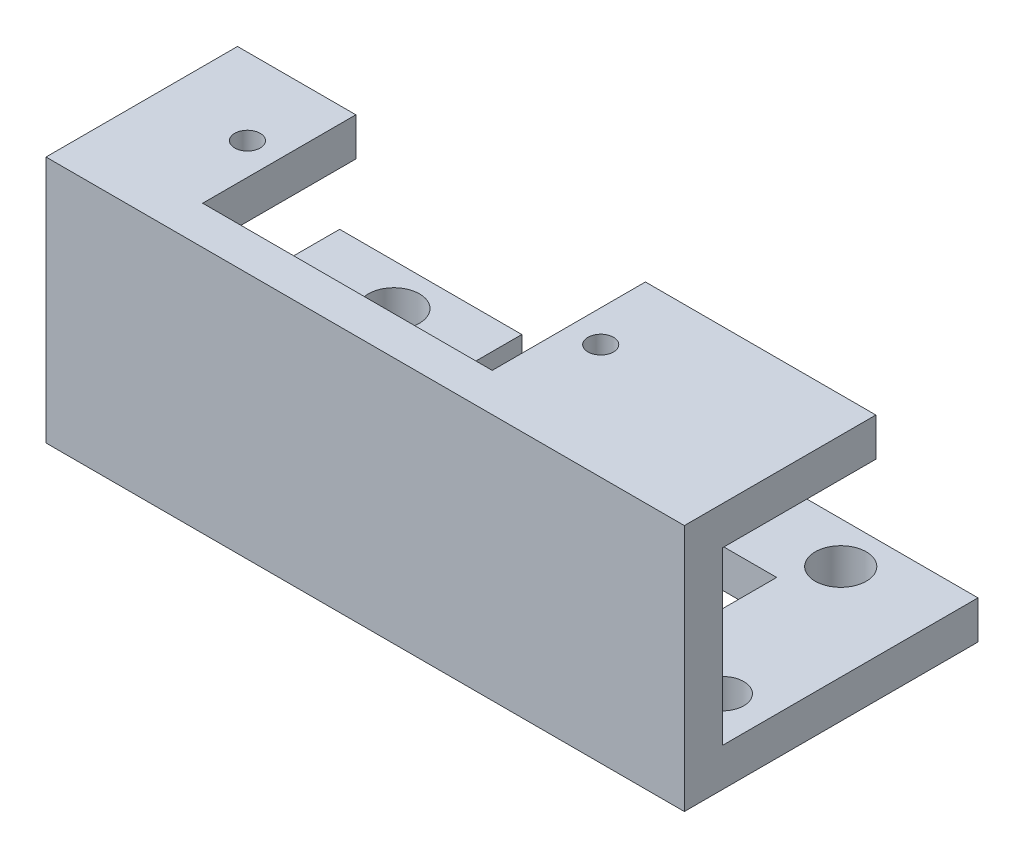
ISO-10303-21;
HEADER;
FILE_DESCRIPTION(('STEP AP214'),'2;1');
FILE_NAME('part.step','',(''),(''),'','','');
FILE_SCHEMA(('AUTOMOTIVE_DESIGN { 1 0 10303 214 1 1 1 1 }'));
ENDSEC;
DATA;
#1=APPLICATION_CONTEXT('core data for automotive mechanical design processes');
#2=APPLICATION_PROTOCOL_DEFINITION('international standard','automotive_design',2000,#1);
#3=PRODUCT_CONTEXT('',#1,'mechanical');
#4=PRODUCT('Part','Part','',(#3));
#5=PRODUCT_RELATED_PRODUCT_CATEGORY('part','',(#4));
#6=PRODUCT_DEFINITION_FORMATION('','',#4);
#7=PRODUCT_DEFINITION_CONTEXT('part definition',#1,'design');
#8=PRODUCT_DEFINITION('design','',#6,#7);
#9=PRODUCT_DEFINITION_SHAPE('','',#8);
#10=(LENGTH_UNIT() NAMED_UNIT(*) SI_UNIT(.MILLI.,.METRE.));
#11=(NAMED_UNIT(*) PLANE_ANGLE_UNIT() SI_UNIT($,.RADIAN.));
#12=(NAMED_UNIT(*) SI_UNIT($,.STERADIAN.) SOLID_ANGLE_UNIT());
#13=UNCERTAINTY_MEASURE_WITH_UNIT(LENGTH_MEASURE(1.E-05),#10,'distance_accuracy_value','');
#14=(GEOMETRIC_REPRESENTATION_CONTEXT(3) GLOBAL_UNCERTAINTY_ASSIGNED_CONTEXT((#13)) GLOBAL_UNIT_ASSIGNED_CONTEXT((#10,
#11,#12)) REPRESENTATION_CONTEXT('',''));
#15=CARTESIAN_POINT('',(0.,0.,0.));
#16=DIRECTION('',(0.,0.,1.));
#17=DIRECTION('',(1.,0.,0.));
#18=AXIS2_PLACEMENT_3D('',#15,#16,#17);
#19=CARTESIAN_POINT('',(40.73,0.,-20.));
#20=DIRECTION('',(1.,0.,0.));
#21=DIRECTION('',(0.,0.,-1.));
#22=AXIS2_PLACEMENT_3D('',#19,#20,#21);
#23=PLANE('',#22);
#24=DIRECTION('',(0.,1.,0.));
#25=VECTOR('',#24,1.);
#26=CARTESIAN_POINT('',(40.73,2.99667999749431,-13.5));
#27=LINE('',#26,#25);
#28=CARTESIAN_POINT('',(40.73,0.,-13.5));
#29=VERTEX_POINT('',#28);
#30=CARTESIAN_POINT('',(40.73,2.99667999749431,-13.5));
#31=VERTEX_POINT('',#30);
#32=EDGE_CURVE('E201',#29,#31,#27,.T.);
#33=ORIENTED_EDGE('',*,*,#32,.F.);
#34=DIRECTION('',(0.,0.,1.));
#35=VECTOR('',#34,1.);
#36=CARTESIAN_POINT('',(40.73,0.,-20.));
#37=LINE('',#36,#35);
#38=CARTESIAN_POINT('',(40.73,0.,0.));
#39=VERTEX_POINT('',#38);
#40=EDGE_CURVE('E261',#29,#39,#37,.T.);
#41=ORIENTED_EDGE('',*,*,#40,.T.);
#42=DIRECTION('',(0.,1.,0.));
#43=VECTOR('',#42,1.);
#44=CARTESIAN_POINT('',(40.73,0.,0.));
#45=LINE('',#44,#43);
#46=CARTESIAN_POINT('',(40.73,2.99667999749431,0.));
#47=VERTEX_POINT('',#46);
#48=EDGE_CURVE('E244',#39,#47,#45,.T.);
#49=ORIENTED_EDGE('',*,*,#48,.T.);
#50=DIRECTION('',(0.,0.,1.));
#51=VECTOR('',#50,1.);
#52=CARTESIAN_POINT('',(40.73,2.99667999749431,-20.));
#53=LINE('',#52,#51);
#54=EDGE_CURVE('E259',#31,#47,#53,.T.);
#55=ORIENTED_EDGE('',*,*,#54,.F.);
#56=EDGE_LOOP('',(#33,#41,#49,#55));
#57=FACE_BOUND('',#56,.T.);
#58=ADVANCED_FACE('F38',(#57),#23,.F.);
#59=CARTESIAN_POINT('',(9.27,0.,-20.));
#60=DIRECTION('',(1.,0.,0.));
#61=DIRECTION('',(0.,0.,-1.));
#62=AXIS2_PLACEMENT_3D('',#59,#60,#61);
#63=PLANE('',#62);
#64=DIRECTION('',(0.,0.,1.));
#65=VECTOR('',#64,1.);
#66=CARTESIAN_POINT('',(9.27,0.,-20.));
#67=LINE('',#66,#65);
#68=CARTESIAN_POINT('',(9.27,0.,-13.5));
#69=VERTEX_POINT('',#68);
#70=CARTESIAN_POINT('',(9.27,0.,0.));
#71=VERTEX_POINT('',#70);
#72=EDGE_CURVE('E60',#69,#71,#67,.T.);
#73=ORIENTED_EDGE('',*,*,#72,.F.);
#74=DIRECTION('',(0.,-1.,0.));
#75=VECTOR('',#74,1.);
#76=CARTESIAN_POINT('',(9.27,2.99667999749431,-13.5));
#77=LINE('',#76,#75);
#78=CARTESIAN_POINT('',(9.27,2.99667999749431,-13.5));
#79=VERTEX_POINT('',#78);
#80=EDGE_CURVE('E55',#79,#69,#77,.T.);
#81=ORIENTED_EDGE('',*,*,#80,.F.);
#82=DIRECTION('',(0.,0.,1.));
#83=VECTOR('',#82,1.);
#84=CARTESIAN_POINT('',(9.27,2.99667999749431,-20.));
#85=LINE('',#84,#83);
#86=CARTESIAN_POINT('',(9.27,2.99667999749431,0.));
#87=VERTEX_POINT('',#86);
#88=EDGE_CURVE('E233',#79,#87,#85,.T.);
#89=ORIENTED_EDGE('',*,*,#88,.T.);
#90=DIRECTION('',(0.,1.,0.));
#91=VECTOR('',#90,1.);
#92=CARTESIAN_POINT('',(9.27,0.,0.));
#93=LINE('',#92,#91);
#94=EDGE_CURVE('E237',#71,#87,#93,.T.);
#95=ORIENTED_EDGE('',*,*,#94,.F.);
#96=EDGE_LOOP('',(#73,#81,#89,#95));
#97=FACE_BOUND('',#96,.T.);
#98=ADVANCED_FACE('F364',(#97),#63,.T.);
#99=CARTESIAN_POINT('',(0.,0.,0.));
#100=DIRECTION('',(0.,0.,-1.));
#101=DIRECTION('',(-1.,0.,0.));
#102=AXIS2_PLACEMENT_3D('',#99,#100,#101);
#103=PLANE('',#102);
#104=ORIENTED_EDGE('',*,*,#94,.T.);
#105=DIRECTION('',(1.,0.,0.));
#106=VECTOR('',#105,1.);
#107=CARTESIAN_POINT('',(0.,2.99667999749431,0.));
#108=LINE('',#107,#106);
#109=CARTESIAN_POINT('',(0.,2.99667999749431,0.));
#110=VERTEX_POINT('',#109);
#111=EDGE_CURVE('E240',#110,#87,#108,.T.);
#112=ORIENTED_EDGE('',*,*,#111,.F.);
#113=DIRECTION('',(0.,-1.,0.));
#114=VECTOR('',#113,1.);
#115=CARTESIAN_POINT('',(0.,0.,0.));
#116=LINE('',#115,#114);
#117=CARTESIAN_POINT('',(0.,16.4,0.));
#118=VERTEX_POINT('',#117);
#119=EDGE_CURVE('E315',#118,#110,#116,.T.);
#120=ORIENTED_EDGE('',*,*,#119,.F.);
#121=DIRECTION('',(1.,0.,0.));
#122=VECTOR('',#121,1.);
#123=CARTESIAN_POINT('',(0.,16.4,0.));
#124=LINE('',#123,#122);
#125=CARTESIAN_POINT('',(9.27,16.4,0.));
#126=VERTEX_POINT('',#125);
#127=EDGE_CURVE('E280',#118,#126,#124,.T.);
#128=ORIENTED_EDGE('',*,*,#127,.T.);
#129=DIRECTION('',(0.,-1.,0.));
#130=VECTOR('',#129,1.);
#131=CARTESIAN_POINT('',(9.27,19.4,0.));
#132=LINE('',#131,#130);
#133=CARTESIAN_POINT('',(9.27,19.4,0.));
#134=VERTEX_POINT('',#133);
#135=EDGE_CURVE('E277',#134,#126,#132,.T.);
#136=ORIENTED_EDGE('',*,*,#135,.F.);
#137=DIRECTION('',(-1.,0.,0.));
#138=VECTOR('',#137,1.);
#139=CARTESIAN_POINT('',(0.,19.4,0.));
#140=LINE('',#139,#138);
#141=CARTESIAN_POINT('',(31.95,19.4,0.));
#142=VERTEX_POINT('',#141);
#143=EDGE_CURVE('E320',#142,#134,#140,.T.);
#144=ORIENTED_EDGE('',*,*,#143,.F.);
#145=DIRECTION('',(0.,-1.,0.));
#146=VECTOR('',#145,1.);
#147=CARTESIAN_POINT('',(31.95,19.4,0.));
#148=LINE('',#147,#146);
#149=CARTESIAN_POINT('',(31.95,16.4,0.));
#150=VERTEX_POINT('',#149);
#151=EDGE_CURVE('E296',#142,#150,#148,.T.);
#152=ORIENTED_EDGE('',*,*,#151,.T.);
#153=DIRECTION('',(-1.,0.,0.));
#154=VECTOR('',#153,1.);
#155=CARTESIAN_POINT('',(50.,16.4,0.));
#156=LINE('',#155,#154);
#157=CARTESIAN_POINT('',(50.,16.4,0.));
#158=VERTEX_POINT('',#157);
#159=EDGE_CURVE('E284',#158,#150,#156,.T.);
#160=ORIENTED_EDGE('',*,*,#159,.F.);
#161=DIRECTION('',(0.,1.,0.));
#162=VECTOR('',#161,1.);
#163=CARTESIAN_POINT('',(50.,0.,0.));
#164=LINE('',#163,#162);
#165=CARTESIAN_POINT('',(50.,2.99667999749431,0.));
#166=VERTEX_POINT('',#165);
#167=EDGE_CURVE('E332',#166,#158,#164,.T.);
#168=ORIENTED_EDGE('',*,*,#167,.F.);
#169=DIRECTION('',(-1.,0.,0.));
#170=VECTOR('',#169,1.);
#171=CARTESIAN_POINT('',(0.,2.99667999749431,0.));
#172=LINE('',#171,#170);
#173=EDGE_CURVE('E186',#166,#47,#172,.T.);
#174=ORIENTED_EDGE('',*,*,#173,.T.);
#175=ORIENTED_EDGE('',*,*,#48,.F.);
#176=DIRECTION('',(1.,0.,0.));
#177=VECTOR('',#176,1.);
#178=CARTESIAN_POINT('',(0.,0.,0.));
#179=LINE('',#178,#177);
#180=EDGE_CURVE('E329',#71,#39,#179,.T.);
#181=ORIENTED_EDGE('',*,*,#180,.F.);
#182=EDGE_LOOP('',(#104,#112,#120,#128,#136,#144,#152,#160,#168,#174,#175,#181));
#183=FACE_BOUND('',#182,.T.);
#184=ADVANCED_FACE('F369',(#183),#103,.T.);
#185=CARTESIAN_POINT('',(0.,0.,3.));
#186=DIRECTION('',(1.,0.,0.));
#187=DIRECTION('',(0.,0.,-1.));
#188=AXIS2_PLACEMENT_3D('',#185,#186,#187);
#189=PLANE('',#188);
#190=DIRECTION('',(0.,0.,-1.));
#191=VECTOR('',#190,1.);
#192=CARTESIAN_POINT('',(0.,19.4,3.));
#193=LINE('',#192,#191);
#194=CARTESIAN_POINT('',(0.,19.4,3.));
#195=VERTEX_POINT('',#194);
#196=CARTESIAN_POINT('',(0.,19.4,-12.));
#197=VERTEX_POINT('',#196);
#198=EDGE_CURVE('E326',#195,#197,#193,.T.);
#199=ORIENTED_EDGE('',*,*,#198,.T.);
#200=DIRECTION('',(0.,-1.,0.));
#201=VECTOR('',#200,1.);
#202=CARTESIAN_POINT('',(0.,19.4,-12.));
#203=LINE('',#202,#201);
#204=CARTESIAN_POINT('',(0.,16.4,-12.));
#205=VERTEX_POINT('',#204);
#206=EDGE_CURVE('E272',#197,#205,#203,.T.);
#207=ORIENTED_EDGE('',*,*,#206,.T.);
#208=DIRECTION('',(0.,0.,1.));
#209=VECTOR('',#208,1.);
#210=CARTESIAN_POINT('',(0.,16.4,-12.));
#211=LINE('',#210,#209);
#212=EDGE_CURVE('E275',#205,#118,#211,.T.);
#213=ORIENTED_EDGE('',*,*,#212,.T.);
#214=ORIENTED_EDGE('',*,*,#119,.T.);
#215=DIRECTION('',(0.,0.,1.));
#216=VECTOR('',#215,1.);
#217=CARTESIAN_POINT('',(0.,2.99667999749431,-20.));
#218=LINE('',#217,#216);
#219=CARTESIAN_POINT('',(0.,2.99667999749431,-20.));
#220=VERTEX_POINT('',#219);
#221=EDGE_CURVE('E231',#220,#110,#218,.T.);
#222=ORIENTED_EDGE('',*,*,#221,.F.);
#223=DIRECTION('',(0.,1.,0.));
#224=VECTOR('',#223,1.);
#225=CARTESIAN_POINT('',(0.,0.,-20.));
#226=LINE('',#225,#224);
#227=CARTESIAN_POINT('',(0.,0.,-20.));
#228=VERTEX_POINT('',#227);
#229=EDGE_CURVE('E241',#228,#220,#226,.T.);
#230=ORIENTED_EDGE('',*,*,#229,.F.);
#231=DIRECTION('',(0.,0.,-1.));
#232=VECTOR('',#231,1.);
#233=CARTESIAN_POINT('',(0.,0.,3.));
#234=LINE('',#233,#232);
#235=CARTESIAN_POINT('',(0.,0.,3.));
#236=VERTEX_POINT('',#235);
#237=EDGE_CURVE('E11',#236,#228,#234,.T.);
#238=ORIENTED_EDGE('',*,*,#237,.F.);
#239=DIRECTION('',(0.,-1.,0.));
#240=VECTOR('',#239,1.);
#241=CARTESIAN_POINT('',(0.,0.,3.));
#242=LINE('',#241,#240);
#243=EDGE_CURVE('E316',#195,#236,#242,.T.);
#244=ORIENTED_EDGE('',*,*,#243,.F.);
#245=EDGE_LOOP('',(#199,#207,#213,#214,#222,#230,#238,#244));
#246=FACE_BOUND('',#245,.T.);
#247=ADVANCED_FACE('F40',(#246),#189,.F.);
#248=CARTESIAN_POINT('',(0.,0.,3.));
#249=DIRECTION('',(0.,1.,0.));
#250=DIRECTION('',(0.,0.,1.));
#251=AXIS2_PLACEMENT_3D('',#248,#249,#250);
#252=PLANE('',#251);
#253=CARTESIAN_POINT('',(3.5,0.,-3.5));
#254=DIRECTION('',(0.,1.,0.));
#255=DIRECTION('',(0.,0.,1.));
#256=AXIS2_PLACEMENT_3D('',#253,#254,#255);
#257=CIRCLE('',#256,1.65);
#258=CARTESIAN_POINT('',(3.5,0.,-1.85));
#259=VERTEX_POINT('',#258);
#260=EDGE_CURVE('E420',#259,#259,#257,.T.);
#261=ORIENTED_EDGE('',*,*,#260,.T.);
#262=EDGE_LOOP('',(#261));
#263=FACE_BOUND('',#262,.T.);
#264=CARTESIAN_POINT('',(7.5,0.,-16.75));
#265=DIRECTION('',(0.,1.,0.));
#266=DIRECTION('',(0.,0.,1.));
#267=AXIS2_PLACEMENT_3D('',#264,#265,#266);
#268=CIRCLE('',#267,2.);
#269=CARTESIAN_POINT('',(7.5,0.,-14.75));
#270=VERTEX_POINT('',#269);
#271=EDGE_CURVE('E423',#270,#270,#268,.T.);
#272=ORIENTED_EDGE('',*,*,#271,.T.);
#273=EDGE_LOOP('',(#272));
#274=FACE_BOUND('',#273,.T.);
#275=CARTESIAN_POINT('',(46.5,0.,-3.5));
#276=DIRECTION('',(0.,1.,0.));
#277=DIRECTION('',(0.,0.,1.));
#278=AXIS2_PLACEMENT_3D('',#275,#276,#277);
#279=CIRCLE('',#278,1.65);
#280=CARTESIAN_POINT('',(46.5,0.,-1.85));
#281=VERTEX_POINT('',#280);
#282=EDGE_CURVE('E203',#281,#281,#279,.T.);
#283=ORIENTED_EDGE('',*,*,#282,.T.);
#284=EDGE_LOOP('',(#283));
#285=FACE_BOUND('',#284,.T.);
#286=CARTESIAN_POINT('',(42.5,0.,-16.75));
#287=DIRECTION('',(0.,1.,0.));
#288=DIRECTION('',(0.,0.,1.));
#289=AXIS2_PLACEMENT_3D('',#286,#287,#288);
#290=CIRCLE('',#289,2.);
#291=CARTESIAN_POINT('',(42.5,0.,-14.75));
#292=VERTEX_POINT('',#291);
#293=EDGE_CURVE('E433',#292,#292,#290,.T.);
#294=ORIENTED_EDGE('',*,*,#293,.T.);
#295=EDGE_LOOP('',(#294));
#296=FACE_BOUND('',#295,.T.);
#297=ORIENTED_EDGE('',*,*,#237,.T.);
#298=DIRECTION('',(1.,0.,0.));
#299=VECTOR('',#298,1.);
#300=CARTESIAN_POINT('',(0.,0.,-20.));
#301=LINE('',#300,#299);
#302=CARTESIAN_POINT('',(14.27,0.,-20.));
#303=VERTEX_POINT('',#302);
#304=EDGE_CURVE('E236',#228,#303,#301,.T.);
#305=ORIENTED_EDGE('',*,*,#304,.T.);
#306=DIRECTION('',(0.,0.,-1.));
#307=VECTOR('',#306,1.);
#308=CARTESIAN_POINT('',(14.27,0.,-20.));
#309=LINE('',#308,#307);
#310=CARTESIAN_POINT('',(14.27,0.,-13.5));
#311=VERTEX_POINT('',#310);
#312=EDGE_CURVE('E221',#311,#303,#309,.T.);
#313=ORIENTED_EDGE('',*,*,#312,.F.);
#314=DIRECTION('',(-1.,0.,0.));
#315=VECTOR('',#314,1.);
#316=CARTESIAN_POINT('',(14.27,0.,-13.5));
#317=LINE('',#316,#315);
#318=EDGE_CURVE('E224',#311,#69,#317,.T.);
#319=ORIENTED_EDGE('',*,*,#318,.T.);
#320=ORIENTED_EDGE('',*,*,#72,.T.);
#321=ORIENTED_EDGE('',*,*,#180,.T.);
#322=ORIENTED_EDGE('',*,*,#40,.F.);
#323=DIRECTION('',(1.,0.,0.));
#324=VECTOR('',#323,1.);
#325=CARTESIAN_POINT('',(35.73,0.,-13.5));
#326=LINE('',#325,#324);
#327=CARTESIAN_POINT('',(35.73,0.,-13.5));
#328=VERTEX_POINT('',#327);
#329=EDGE_CURVE('E192',#328,#29,#326,.T.);
#330=ORIENTED_EDGE('',*,*,#329,.F.);
#331=DIRECTION('',(0.,0.,1.));
#332=VECTOR('',#331,1.);
#333=CARTESIAN_POINT('',(35.73,0.,-20.));
#334=LINE('',#333,#332);
#335=CARTESIAN_POINT('',(35.73,0.,-20.));
#336=VERTEX_POINT('',#335);
#337=EDGE_CURVE('E189',#336,#328,#334,.T.);
#338=ORIENTED_EDGE('',*,*,#337,.F.);
#339=DIRECTION('',(-1.,0.,0.));
#340=VECTOR('',#339,1.);
#341=CARTESIAN_POINT('',(0.,0.,-20.));
#342=LINE('',#341,#340);
#343=CARTESIAN_POINT('',(50.,0.,-20.));
#344=VERTEX_POINT('',#343);
#345=EDGE_CURVE('E175',#344,#336,#342,.T.);
#346=ORIENTED_EDGE('',*,*,#345,.F.);
#347=DIRECTION('',(0.,0.,-1.));
#348=VECTOR('',#347,1.);
#349=CARTESIAN_POINT('',(50.,0.,3.));
#350=LINE('',#349,#348);
#351=CARTESIAN_POINT('',(50.,0.,3.));
#352=VERTEX_POINT('',#351);
#353=EDGE_CURVE('E47',#352,#344,#350,.T.);
#354=ORIENTED_EDGE('',*,*,#353,.F.);
#355=DIRECTION('',(1.,0.,0.));
#356=VECTOR('',#355,1.);
#357=CARTESIAN_POINT('',(0.,0.,3.));
#358=LINE('',#357,#356);
#359=EDGE_CURVE('E319',#236,#352,#358,.T.);
#360=ORIENTED_EDGE('',*,*,#359,.F.);
#361=EDGE_LOOP('',(#297,#305,#313,#319,#320,#321,#322,#330,#338,#346,#354,#360));
#362=FACE_BOUND('',#361,.T.);
#363=ADVANCED_FACE('F190',(#263,#274,#285,#296,#362),#252,.F.);
#364=CARTESIAN_POINT('',(50.,0.,3.));
#365=DIRECTION('',(-1.,0.,0.));
#366=DIRECTION('',(0.,0.,1.));
#367=AXIS2_PLACEMENT_3D('',#364,#365,#366);
#368=PLANE('',#367);
#369=ORIENTED_EDGE('',*,*,#353,.T.);
#370=DIRECTION('',(0.,-1.,0.));
#371=VECTOR('',#370,1.);
#372=CARTESIAN_POINT('',(50.,0.,-20.));
#373=LINE('',#372,#371);
#374=CARTESIAN_POINT('',(50.,2.99667999749431,-20.));
#375=VERTEX_POINT('',#374);
#376=EDGE_CURVE('E182',#375,#344,#373,.T.);
#377=ORIENTED_EDGE('',*,*,#376,.F.);
#378=DIRECTION('',(0.,0.,1.));
#379=VECTOR('',#378,1.);
#380=CARTESIAN_POINT('',(50.,2.99667999749431,-20.));
#381=LINE('',#380,#379);
#382=EDGE_CURVE('E252',#375,#166,#381,.T.);
#383=ORIENTED_EDGE('',*,*,#382,.T.);
#384=ORIENTED_EDGE('',*,*,#167,.T.);
#385=DIRECTION('',(0.,0.,1.));
#386=VECTOR('',#385,1.);
#387=CARTESIAN_POINT('',(50.,16.4,-12.));
#388=LINE('',#387,#386);
#389=CARTESIAN_POINT('',(50.,16.4,-12.));
#390=VERTEX_POINT('',#389);
#391=EDGE_CURVE('E304',#390,#158,#388,.T.);
#392=ORIENTED_EDGE('',*,*,#391,.F.);
#393=DIRECTION('',(0.,-1.,0.));
#394=VECTOR('',#393,1.);
#395=CARTESIAN_POINT('',(50.,19.4,-12.));
#396=LINE('',#395,#394);
#397=CARTESIAN_POINT('',(50.,19.4,-12.));
#398=VERTEX_POINT('',#397);
#399=EDGE_CURVE('E302',#398,#390,#396,.T.);
#400=ORIENTED_EDGE('',*,*,#399,.F.);
#401=DIRECTION('',(0.,0.,-1.));
#402=VECTOR('',#401,1.);
#403=CARTESIAN_POINT('',(50.,19.4,3.));
#404=LINE('',#403,#402);
#405=CARTESIAN_POINT('',(50.,19.4,3.));
#406=VERTEX_POINT('',#405);
#407=EDGE_CURVE('E337',#406,#398,#404,.T.);
#408=ORIENTED_EDGE('',*,*,#407,.F.);
#409=DIRECTION('',(0.,1.,0.));
#410=VECTOR('',#409,1.);
#411=CARTESIAN_POINT('',(50.,0.,3.));
#412=LINE('',#411,#410);
#413=EDGE_CURVE('E322',#352,#406,#412,.T.);
#414=ORIENTED_EDGE('',*,*,#413,.F.);
#415=EDGE_LOOP('',(#369,#377,#383,#384,#392,#400,#408,#414));
#416=FACE_BOUND('',#415,.T.);
#417=ADVANCED_FACE('F442',(#416),#368,.F.);
#418=CARTESIAN_POINT('',(0.,19.4,3.));
#419=DIRECTION('',(0.,-1.,0.));
#420=DIRECTION('',(0.,0.,-1.));
#421=AXIS2_PLACEMENT_3D('',#418,#419,#420);
#422=PLANE('',#421);
#423=CARTESIAN_POINT('',(34.45,19.4,-6.));
#424=DIRECTION('',(0.,1.,0.));
#425=DIRECTION('',(0.,0.,1.));
#426=AXIS2_PLACEMENT_3D('',#423,#424,#425);
#427=CIRCLE('',#426,0.999999999999998);
#428=CARTESIAN_POINT('',(34.45,19.4,-5.));
#429=VERTEX_POINT('',#428);
#430=EDGE_CURVE('E264',#429,#429,#427,.T.);
#431=ORIENTED_EDGE('',*,*,#430,.F.);
#432=EDGE_LOOP('',(#431));
#433=FACE_BOUND('',#432,.T.);
#434=CARTESIAN_POINT('',(6.78,19.4,-6.));
#435=DIRECTION('',(0.,1.,0.));
#436=DIRECTION('',(0.,0.,1.));
#437=AXIS2_PLACEMENT_3D('',#434,#435,#436);
#438=CIRCLE('',#437,1.);
#439=CARTESIAN_POINT('',(6.78,19.4,-5.));
#440=VERTEX_POINT('',#439);
#441=EDGE_CURVE('E263',#440,#440,#438,.T.);
#442=ORIENTED_EDGE('',*,*,#441,.F.);
#443=EDGE_LOOP('',(#442));
#444=FACE_BOUND('',#443,.T.);
#445=ORIENTED_EDGE('',*,*,#407,.T.);
#446=DIRECTION('',(-1.,0.,0.));
#447=VECTOR('',#446,1.);
#448=CARTESIAN_POINT('',(50.,19.4,-12.));
#449=LINE('',#448,#447);
#450=CARTESIAN_POINT('',(31.95,19.4,-12.));
#451=VERTEX_POINT('',#450);
#452=EDGE_CURVE('E299',#398,#451,#449,.T.);
#453=ORIENTED_EDGE('',*,*,#452,.T.);
#454=DIRECTION('',(0.,0.,1.));
#455=VECTOR('',#454,1.);
#456=CARTESIAN_POINT('',(31.95,19.4,-12.));
#457=LINE('',#456,#455);
#458=EDGE_CURVE('E310',#451,#142,#457,.T.);
#459=ORIENTED_EDGE('',*,*,#458,.T.);
#460=ORIENTED_EDGE('',*,*,#143,.T.);
#461=DIRECTION('',(0.,0.,1.));
#462=VECTOR('',#461,1.);
#463=CARTESIAN_POINT('',(9.27,19.4,-12.));
#464=LINE('',#463,#462);
#465=CARTESIAN_POINT('',(9.27,19.4,-12.));
#466=VERTEX_POINT('',#465);
#467=EDGE_CURVE('E273',#466,#134,#464,.T.);
#468=ORIENTED_EDGE('',*,*,#467,.F.);
#469=DIRECTION('',(1.,0.,0.));
#470=VECTOR('',#469,1.);
#471=CARTESIAN_POINT('',(0.,19.4,-12.));
#472=LINE('',#471,#470);
#473=EDGE_CURVE('E287',#197,#466,#472,.T.);
#474=ORIENTED_EDGE('',*,*,#473,.F.);
#475=ORIENTED_EDGE('',*,*,#198,.F.);
#476=DIRECTION('',(-1.,0.,0.));
#477=VECTOR('',#476,1.);
#478=CARTESIAN_POINT('',(0.,19.4,3.));
#479=LINE('',#478,#477);
#480=EDGE_CURVE('E324',#406,#195,#479,.T.);
#481=ORIENTED_EDGE('',*,*,#480,.F.);
#482=EDGE_LOOP('',(#445,#453,#459,#460,#468,#474,#475,#481));
#483=FACE_BOUND('',#482,.T.);
#484=ADVANCED_FACE('F447',(#433,#444,#483),#422,.F.);
#485=CARTESIAN_POINT('',(0.,0.,3.));
#486=DIRECTION('',(0.,0.,-1.));
#487=DIRECTION('',(-1.,0.,0.));
#488=AXIS2_PLACEMENT_3D('',#485,#486,#487);
#489=PLANE('',#488);
#490=ORIENTED_EDGE('',*,*,#243,.T.);
#491=ORIENTED_EDGE('',*,*,#359,.T.);
#492=ORIENTED_EDGE('',*,*,#413,.T.);
#493=ORIENTED_EDGE('',*,*,#480,.T.);
#494=EDGE_LOOP('',(#490,#491,#492,#493));
#495=FACE_BOUND('',#494,.T.);
#496=ADVANCED_FACE('F455',(#495),#489,.F.);
#497=CARTESIAN_POINT('',(50.,16.4,-12.));
#498=DIRECTION('',(0.,1.,0.));
#499=DIRECTION('',(0.,0.,1.));
#500=AXIS2_PLACEMENT_3D('',#497,#498,#499);
#501=PLANE('',#500);
#502=CARTESIAN_POINT('',(34.45,16.4,-6.));
#503=DIRECTION('',(0.,1.,0.));
#504=DIRECTION('',(0.,0.,1.));
#505=AXIS2_PLACEMENT_3D('',#502,#503,#504);
#506=CIRCLE('',#505,0.999999999999998);
#507=CARTESIAN_POINT('',(34.45,16.4,-5.));
#508=VERTEX_POINT('',#507);
#509=EDGE_CURVE('E42',#508,#508,#506,.T.);
#510=ORIENTED_EDGE('',*,*,#509,.T.);
#511=EDGE_LOOP('',(#510));
#512=FACE_BOUND('',#511,.T.);
#513=ORIENTED_EDGE('',*,*,#159,.T.);
#514=DIRECTION('',(0.,0.,1.));
#515=VECTOR('',#514,1.);
#516=CARTESIAN_POINT('',(31.95,16.4,-12.));
#517=LINE('',#516,#515);
#518=CARTESIAN_POINT('',(31.95,16.4,-12.));
#519=VERTEX_POINT('',#518);
#520=EDGE_CURVE('E312',#519,#150,#517,.T.);
#521=ORIENTED_EDGE('',*,*,#520,.F.);
#522=DIRECTION('',(-1.,0.,0.));
#523=VECTOR('',#522,1.);
#524=CARTESIAN_POINT('',(50.,16.4,-12.));
#525=LINE('',#524,#523);
#526=EDGE_CURVE('E293',#390,#519,#525,.T.);
#527=ORIENTED_EDGE('',*,*,#526,.F.);
#528=ORIENTED_EDGE('',*,*,#391,.T.);
#529=EDGE_LOOP('',(#513,#521,#527,#528));
#530=FACE_BOUND('',#529,.T.);
#531=ADVANCED_FACE('F345',(#512,#530),#501,.F.);
#532=CARTESIAN_POINT('',(31.95,19.4,-12.));
#533=DIRECTION('',(-1.,0.,0.));
#534=DIRECTION('',(0.,0.,1.));
#535=AXIS2_PLACEMENT_3D('',#532,#533,#534);
#536=PLANE('',#535);
#537=ORIENTED_EDGE('',*,*,#151,.F.);
#538=ORIENTED_EDGE('',*,*,#458,.F.);
#539=DIRECTION('',(0.,-1.,0.));
#540=VECTOR('',#539,1.);
#541=CARTESIAN_POINT('',(31.95,19.4,-12.));
#542=LINE('',#541,#540);
#543=EDGE_CURVE('E295',#451,#519,#542,.T.);
#544=ORIENTED_EDGE('',*,*,#543,.T.);
#545=ORIENTED_EDGE('',*,*,#520,.T.);
#546=EDGE_LOOP('',(#537,#538,#544,#545));
#547=FACE_BOUND('',#546,.T.);
#548=ADVANCED_FACE('F465',(#547),#536,.T.);
#549=CARTESIAN_POINT('',(0.,0.,-12.));
#550=DIRECTION('',(0.,0.,1.));
#551=DIRECTION('',(1.,0.,0.));
#552=AXIS2_PLACEMENT_3D('',#549,#550,#551);
#553=PLANE('',#552);
#554=ORIENTED_EDGE('',*,*,#526,.T.);
#555=ORIENTED_EDGE('',*,*,#543,.F.);
#556=ORIENTED_EDGE('',*,*,#452,.F.);
#557=ORIENTED_EDGE('',*,*,#399,.T.);
#558=EDGE_LOOP('',(#554,#555,#556,#557));
#559=FACE_BOUND('',#558,.T.);
#560=ADVANCED_FACE('F468',(#559),#553,.F.);
#561=CARTESIAN_POINT('',(0.,16.4,-12.));
#562=DIRECTION('',(0.,-1.,0.));
#563=DIRECTION('',(0.,0.,-1.));
#564=AXIS2_PLACEMENT_3D('',#561,#562,#563);
#565=PLANE('',#564);
#566=CARTESIAN_POINT('',(6.78,16.4,-6.));
#567=DIRECTION('',(0.,-1.,0.));
#568=DIRECTION('',(0.,0.,-1.));
#569=AXIS2_PLACEMENT_3D('',#566,#567,#568);
#570=CIRCLE('',#569,1.);
#571=CARTESIAN_POINT('',(6.78,16.4,-7.));
#572=VERTEX_POINT('',#571);
#573=EDGE_CURVE('E267',#572,#572,#570,.T.);
#574=ORIENTED_EDGE('',*,*,#573,.F.);
#575=EDGE_LOOP('',(#574));
#576=FACE_BOUND('',#575,.T.);
#577=ORIENTED_EDGE('',*,*,#127,.F.);
#578=ORIENTED_EDGE('',*,*,#212,.F.);
#579=DIRECTION('',(1.,0.,0.));
#580=VECTOR('',#579,1.);
#581=CARTESIAN_POINT('',(0.,16.4,-12.));
#582=LINE('',#581,#580);
#583=CARTESIAN_POINT('',(9.27,16.4,-12.));
#584=VERTEX_POINT('',#583);
#585=EDGE_CURVE('E281',#205,#584,#582,.T.);
#586=ORIENTED_EDGE('',*,*,#585,.T.);
#587=DIRECTION('',(0.,0.,1.));
#588=VECTOR('',#587,1.);
#589=CARTESIAN_POINT('',(9.27,16.4,-12.));
#590=LINE('',#589,#588);
#591=EDGE_CURVE('E270',#584,#126,#590,.T.);
#592=ORIENTED_EDGE('',*,*,#591,.T.);
#593=EDGE_LOOP('',(#577,#578,#586,#592));
#594=FACE_BOUND('',#593,.T.);
#595=ADVANCED_FACE('F472',(#576,#594),#565,.T.);
#596=CARTESIAN_POINT('',(9.27,19.4,-12.));
#597=DIRECTION('',(-1.,0.,0.));
#598=DIRECTION('',(0.,0.,1.));
#599=AXIS2_PLACEMENT_3D('',#596,#597,#598);
#600=PLANE('',#599);
#601=ORIENTED_EDGE('',*,*,#135,.T.);
#602=ORIENTED_EDGE('',*,*,#591,.F.);
#603=DIRECTION('',(0.,-1.,0.));
#604=VECTOR('',#603,1.);
#605=CARTESIAN_POINT('',(9.27,19.4,-12.));
#606=LINE('',#605,#604);
#607=EDGE_CURVE('E289',#466,#584,#606,.T.);
#608=ORIENTED_EDGE('',*,*,#607,.F.);
#609=ORIENTED_EDGE('',*,*,#467,.T.);
#610=EDGE_LOOP('',(#601,#602,#608,#609));
#611=FACE_BOUND('',#610,.T.);
#612=ADVANCED_FACE('F476',(#611),#600,.F.);
#613=CARTESIAN_POINT('',(0.,0.,-12.));
#614=DIRECTION('',(0.,0.,-1.));
#615=DIRECTION('',(-1.,0.,0.));
#616=AXIS2_PLACEMENT_3D('',#613,#614,#615);
#617=PLANE('',#616);
#618=ORIENTED_EDGE('',*,*,#585,.F.);
#619=ORIENTED_EDGE('',*,*,#206,.F.);
#620=ORIENTED_EDGE('',*,*,#473,.T.);
#621=ORIENTED_EDGE('',*,*,#607,.T.);
#622=EDGE_LOOP('',(#618,#619,#620,#621));
#623=FACE_BOUND('',#622,.T.);
#624=ADVANCED_FACE('F360',(#623),#617,.T.);
#625=CARTESIAN_POINT('',(6.78,15.4,-6.));
#626=DIRECTION('',(0.,1.,0.));
#627=DIRECTION('',(0.,0.,1.));
#628=AXIS2_PLACEMENT_3D('',#625,#626,#627);
#629=CYLINDRICAL_SURFACE('',#628,1.);
#630=ORIENTED_EDGE('',*,*,#573,.T.);
#631=EDGE_LOOP('',(#630));
#632=FACE_BOUND('',#631,.T.);
#633=ORIENTED_EDGE('',*,*,#441,.T.);
#634=EDGE_LOOP('',(#633));
#635=FACE_BOUND('',#634,.T.);
#636=ADVANCED_FACE('F351',(#632,#635),#629,.F.);
#637=CARTESIAN_POINT('',(34.45,15.4,-6.));
#638=DIRECTION('',(0.,1.,0.));
#639=DIRECTION('',(0.,0.,1.));
#640=AXIS2_PLACEMENT_3D('',#637,#638,#639);
#641=CYLINDRICAL_SURFACE('',#640,0.999999999999998);
#642=ORIENTED_EDGE('',*,*,#430,.T.);
#643=EDGE_LOOP('',(#642));
#644=FACE_BOUND('',#643,.T.);
#645=ORIENTED_EDGE('',*,*,#509,.F.);
#646=EDGE_LOOP('',(#645));
#647=FACE_BOUND('',#646,.T.);
#648=ADVANCED_FACE('F348',(#644,#647),#641,.F.);
#649=CARTESIAN_POINT('',(0.,2.99667999749431,-20.));
#650=DIRECTION('',(0.,1.,0.));
#651=DIRECTION('',(0.,0.,1.));
#652=AXIS2_PLACEMENT_3D('',#649,#650,#651);
#653=PLANE('',#652);
#654=CARTESIAN_POINT('',(46.5,2.99667999749431,-3.5));
#655=DIRECTION('',(0.,1.,0.));
#656=DIRECTION('',(0.,0.,1.));
#657=AXIS2_PLACEMENT_3D('',#654,#655,#656);
#658=CIRCLE('',#657,1.65);
#659=CARTESIAN_POINT('',(46.5,2.99667999749431,-1.85));
#660=VERTEX_POINT('',#659);
#661=EDGE_CURVE('E426',#660,#660,#658,.T.);
#662=ORIENTED_EDGE('',*,*,#661,.F.);
#663=EDGE_LOOP('',(#662));
#664=FACE_BOUND('',#663,.T.);
#665=CARTESIAN_POINT('',(42.5,2.99667999749431,-16.75));
#666=DIRECTION('',(0.,1.,0.));
#667=DIRECTION('',(0.,0.,1.));
#668=AXIS2_PLACEMENT_3D('',#665,#666,#667);
#669=CIRCLE('',#668,2.);
#670=CARTESIAN_POINT('',(42.5,2.99667999749431,-14.75));
#671=VERTEX_POINT('',#670);
#672=EDGE_CURVE('E422',#671,#671,#669,.T.);
#673=ORIENTED_EDGE('',*,*,#672,.F.);
#674=EDGE_LOOP('',(#673));
#675=FACE_BOUND('',#674,.T.);
#676=ORIENTED_EDGE('',*,*,#173,.F.);
#677=ORIENTED_EDGE('',*,*,#382,.F.);
#678=DIRECTION('',(-1.,0.,0.));
#679=VECTOR('',#678,1.);
#680=CARTESIAN_POINT('',(0.,2.99667999749431,-20.));
#681=LINE('',#680,#679);
#682=CARTESIAN_POINT('',(35.73,2.99667999749431,-20.));
#683=VERTEX_POINT('',#682);
#684=EDGE_CURVE('E185',#375,#683,#681,.T.);
#685=ORIENTED_EDGE('',*,*,#684,.T.);
#686=DIRECTION('',(0.,0.,-1.));
#687=VECTOR('',#686,1.);
#688=CARTESIAN_POINT('',(35.73,2.99667999749431,-20.));
#689=LINE('',#688,#687);
#690=CARTESIAN_POINT('',(35.73,2.99667999749431,-13.5));
#691=VERTEX_POINT('',#690);
#692=EDGE_CURVE('E200',#691,#683,#689,.T.);
#693=ORIENTED_EDGE('',*,*,#692,.F.);
#694=DIRECTION('',(1.,0.,0.));
#695=VECTOR('',#694,1.);
#696=CARTESIAN_POINT('',(35.73,2.99667999749431,-13.5));
#697=LINE('',#696,#695);
#698=EDGE_CURVE('E209',#691,#31,#697,.T.);
#699=ORIENTED_EDGE('',*,*,#698,.T.);
#700=ORIENTED_EDGE('',*,*,#54,.T.);
#701=EDGE_LOOP('',(#676,#677,#685,#693,#699,#700));
#702=FACE_BOUND('',#701,.T.);
#703=ADVANCED_FACE('F350',(#664,#675,#702),#653,.T.);
#704=CARTESIAN_POINT('',(0.,0.,-20.));
#705=DIRECTION('',(0.,0.,-1.));
#706=DIRECTION('',(-1.,0.,0.));
#707=AXIS2_PLACEMENT_3D('',#704,#705,#706);
#708=PLANE('',#707);
#709=ORIENTED_EDGE('',*,*,#345,.T.);
#710=DIRECTION('',(0.,-1.,0.));
#711=VECTOR('',#710,1.);
#712=CARTESIAN_POINT('',(35.73,2.99667999749431,-20.));
#713=LINE('',#712,#711);
#714=EDGE_CURVE('E180',#683,#336,#713,.T.);
#715=ORIENTED_EDGE('',*,*,#714,.F.);
#716=ORIENTED_EDGE('',*,*,#684,.F.);
#717=ORIENTED_EDGE('',*,*,#376,.T.);
#718=EDGE_LOOP('',(#709,#715,#716,#717));
#719=FACE_BOUND('',#718,.T.);
#720=ADVANCED_FACE('F177',(#719),#708,.T.);
#721=CARTESIAN_POINT('',(0.,2.99667999749431,-20.));
#722=DIRECTION('',(0.,-1.,0.));
#723=DIRECTION('',(0.,0.,-1.));
#724=AXIS2_PLACEMENT_3D('',#721,#722,#723);
#725=PLANE('',#724);
#726=CARTESIAN_POINT('',(3.5,2.99667999749431,-3.5));
#727=DIRECTION('',(0.,1.,0.));
#728=DIRECTION('',(0.,0.,1.));
#729=AXIS2_PLACEMENT_3D('',#726,#727,#728);
#730=CIRCLE('',#729,1.65);
#731=CARTESIAN_POINT('',(3.5,2.99667999749431,-1.85));
#732=VERTEX_POINT('',#731);
#733=EDGE_CURVE('E417',#732,#732,#730,.T.);
#734=ORIENTED_EDGE('',*,*,#733,.F.);
#735=EDGE_LOOP('',(#734));
#736=FACE_BOUND('',#735,.T.);
#737=CARTESIAN_POINT('',(7.5,2.99667999749431,-16.75));
#738=DIRECTION('',(0.,1.,0.));
#739=DIRECTION('',(0.,0.,1.));
#740=AXIS2_PLACEMENT_3D('',#737,#738,#739);
#741=CIRCLE('',#740,2.);
#742=CARTESIAN_POINT('',(7.5,2.99667999749431,-14.75));
#743=VERTEX_POINT('',#742);
#744=EDGE_CURVE('E744',#743,#743,#741,.T.);
#745=ORIENTED_EDGE('',*,*,#744,.F.);
#746=EDGE_LOOP('',(#745));
#747=FACE_BOUND('',#746,.T.);
#748=ORIENTED_EDGE('',*,*,#111,.T.);
#749=ORIENTED_EDGE('',*,*,#88,.F.);
#750=DIRECTION('',(-1.,0.,0.));
#751=VECTOR('',#750,1.);
#752=CARTESIAN_POINT('',(14.27,2.99667999749431,-13.5));
#753=LINE('',#752,#751);
#754=CARTESIAN_POINT('',(14.27,2.99667999749431,-13.5));
#755=VERTEX_POINT('',#754);
#756=EDGE_CURVE('E228',#755,#79,#753,.T.);
#757=ORIENTED_EDGE('',*,*,#756,.F.);
#758=DIRECTION('',(0.,0.,1.));
#759=VECTOR('',#758,1.);
#760=CARTESIAN_POINT('',(14.27,2.99667999749431,-20.));
#761=LINE('',#760,#759);
#762=CARTESIAN_POINT('',(14.27,2.99667999749431,-20.));
#763=VERTEX_POINT('',#762);
#764=EDGE_CURVE('E217',#763,#755,#761,.T.);
#765=ORIENTED_EDGE('',*,*,#764,.F.);
#766=DIRECTION('',(1.,0.,0.));
#767=VECTOR('',#766,1.);
#768=CARTESIAN_POINT('',(0.,2.99667999749431,-20.));
#769=LINE('',#768,#767);
#770=EDGE_CURVE('E246',#220,#763,#769,.T.);
#771=ORIENTED_EDGE('',*,*,#770,.F.);
#772=ORIENTED_EDGE('',*,*,#221,.T.);
#773=EDGE_LOOP('',(#748,#749,#757,#765,#771,#772));
#774=FACE_BOUND('',#773,.T.);
#775=ADVANCED_FACE('F375',(#736,#747,#774),#725,.F.);
#776=CARTESIAN_POINT('',(0.,0.,-20.));
#777=DIRECTION('',(0.,0.,-1.));
#778=DIRECTION('',(-1.,0.,0.));
#779=AXIS2_PLACEMENT_3D('',#776,#777,#778);
#780=PLANE('',#779);
#781=ORIENTED_EDGE('',*,*,#229,.T.);
#782=ORIENTED_EDGE('',*,*,#770,.T.);
#783=DIRECTION('',(0.,1.,0.));
#784=VECTOR('',#783,1.);
#785=CARTESIAN_POINT('',(14.27,2.99667999749431,-20.));
#786=LINE('',#785,#784);
#787=EDGE_CURVE('E214',#303,#763,#786,.T.);
#788=ORIENTED_EDGE('',*,*,#787,.F.);
#789=ORIENTED_EDGE('',*,*,#304,.F.);
#790=EDGE_LOOP('',(#781,#782,#788,#789));
#791=FACE_BOUND('',#790,.T.);
#792=ADVANCED_FACE('F376',(#791),#780,.T.);
#793=CARTESIAN_POINT('',(14.27,2.99667999749431,-13.5));
#794=DIRECTION('',(0.,0.,-1.));
#795=DIRECTION('',(-1.,0.,0.));
#796=AXIS2_PLACEMENT_3D('',#793,#794,#795);
#797=PLANE('',#796);
#798=ORIENTED_EDGE('',*,*,#80,.T.);
#799=ORIENTED_EDGE('',*,*,#318,.F.);
#800=DIRECTION('',(0.,-1.,0.));
#801=VECTOR('',#800,1.);
#802=CARTESIAN_POINT('',(14.27,2.99667999749431,-13.5));
#803=LINE('',#802,#801);
#804=EDGE_CURVE('E219',#755,#311,#803,.T.);
#805=ORIENTED_EDGE('',*,*,#804,.F.);
#806=ORIENTED_EDGE('',*,*,#756,.T.);
#807=EDGE_LOOP('',(#798,#799,#805,#806));
#808=FACE_BOUND('',#807,.T.);
#809=ADVANCED_FACE('F378',(#808),#797,.F.);
#810=CARTESIAN_POINT('',(14.27,0.,0.));
#811=DIRECTION('',(-1.,0.,0.));
#812=DIRECTION('',(0.,0.,1.));
#813=AXIS2_PLACEMENT_3D('',#810,#811,#812);
#814=PLANE('',#813);
#815=ORIENTED_EDGE('',*,*,#787,.T.);
#816=ORIENTED_EDGE('',*,*,#764,.T.);
#817=ORIENTED_EDGE('',*,*,#804,.T.);
#818=ORIENTED_EDGE('',*,*,#312,.T.);
#819=EDGE_LOOP('',(#815,#816,#817,#818));
#820=FACE_BOUND('',#819,.T.);
#821=ADVANCED_FACE('F386',(#820),#814,.F.);
#822=CARTESIAN_POINT('',(35.73,2.99667999749431,-13.5));
#823=DIRECTION('',(0.,0.,-1.));
#824=DIRECTION('',(-1.,0.,0.));
#825=AXIS2_PLACEMENT_3D('',#822,#823,#824);
#826=PLANE('',#825);
#827=ORIENTED_EDGE('',*,*,#32,.T.);
#828=ORIENTED_EDGE('',*,*,#698,.F.);
#829=DIRECTION('',(0.,1.,0.));
#830=VECTOR('',#829,1.);
#831=CARTESIAN_POINT('',(35.73,2.99667999749431,-13.5));
#832=LINE('',#831,#830);
#833=EDGE_CURVE('E195',#328,#691,#832,.T.);
#834=ORIENTED_EDGE('',*,*,#833,.F.);
#835=ORIENTED_EDGE('',*,*,#329,.T.);
#836=EDGE_LOOP('',(#827,#828,#834,#835));
#837=FACE_BOUND('',#836,.T.);
#838=ADVANCED_FACE('F390',(#837),#826,.F.);
#839=CARTESIAN_POINT('',(35.73,0.,0.));
#840=DIRECTION('',(-1.,0.,0.));
#841=DIRECTION('',(0.,0.,1.));
#842=AXIS2_PLACEMENT_3D('',#839,#840,#841);
#843=PLANE('',#842);
#844=ORIENTED_EDGE('',*,*,#714,.T.);
#845=ORIENTED_EDGE('',*,*,#337,.T.);
#846=ORIENTED_EDGE('',*,*,#833,.T.);
#847=ORIENTED_EDGE('',*,*,#692,.T.);
#848=EDGE_LOOP('',(#844,#845,#846,#847));
#849=FACE_BOUND('',#848,.T.);
#850=ADVANCED_FACE('F198',(#849),#843,.T.);
#851=CARTESIAN_POINT('',(42.5,-2.00332000250569,-16.75));
#852=DIRECTION('',(0.,1.,0.));
#853=DIRECTION('',(0.,0.,1.));
#854=AXIS2_PLACEMENT_3D('',#851,#852,#853);
#855=CYLINDRICAL_SURFACE('',#854,2.);
#856=ORIENTED_EDGE('',*,*,#672,.T.);
#857=EDGE_LOOP('',(#856));
#858=FACE_BOUND('',#857,.T.);
#859=ORIENTED_EDGE('',*,*,#293,.F.);
#860=EDGE_LOOP('',(#859));
#861=FACE_BOUND('',#860,.T.);
#862=ADVANCED_FACE('F397',(#858,#861),#855,.F.);
#863=CARTESIAN_POINT('',(46.5,-2.00332000250569,-3.5));
#864=DIRECTION('',(0.,1.,0.));
#865=DIRECTION('',(0.,0.,1.));
#866=AXIS2_PLACEMENT_3D('',#863,#864,#865);
#867=CYLINDRICAL_SURFACE('',#866,1.65);
#868=ORIENTED_EDGE('',*,*,#661,.T.);
#869=EDGE_LOOP('',(#868));
#870=FACE_BOUND('',#869,.T.);
#871=ORIENTED_EDGE('',*,*,#282,.F.);
#872=EDGE_LOOP('',(#871));
#873=FACE_BOUND('',#872,.T.);
#874=ADVANCED_FACE('F400',(#870,#873),#867,.F.);
#875=CARTESIAN_POINT('',(7.5,-2.00332000250568,-16.75));
#876=DIRECTION('',(0.,1.,0.));
#877=DIRECTION('',(0.,0.,1.));
#878=AXIS2_PLACEMENT_3D('',#875,#876,#877);
#879=CYLINDRICAL_SURFACE('',#878,2.);
#880=ORIENTED_EDGE('',*,*,#744,.T.);
#881=EDGE_LOOP('',(#880));
#882=FACE_BOUND('',#881,.T.);
#883=ORIENTED_EDGE('',*,*,#271,.F.);
#884=EDGE_LOOP('',(#883));
#885=FACE_BOUND('',#884,.T.);
#886=ADVANCED_FACE('F404',(#882,#885),#879,.F.);
#887=CARTESIAN_POINT('',(3.5,-2.00332000250568,-3.5));
#888=DIRECTION('',(0.,1.,0.));
#889=DIRECTION('',(0.,0.,1.));
#890=AXIS2_PLACEMENT_3D('',#887,#888,#889);
#891=CYLINDRICAL_SURFACE('',#890,1.65);
#892=ORIENTED_EDGE('',*,*,#733,.T.);
#893=EDGE_LOOP('',(#892));
#894=FACE_BOUND('',#893,.T.);
#895=ORIENTED_EDGE('',*,*,#260,.F.);
#896=EDGE_LOOP('',(#895));
#897=FACE_BOUND('',#896,.T.);
#898=ADVANCED_FACE('F408',(#894,#897),#891,.F.);
#899=CLOSED_SHELL('',(#58,#98,#184,#247,#363,#417,#484,#496,#531,#548,#560,#595,#612,#624,#636,
#648,#703,#720,#775,#792,#809,#821,#838,#850,#862,#874,#886,#898));
#900=MANIFOLD_SOLID_BREP('B2',#899);
#901=ADVANCED_BREP_SHAPE_REPRESENTATION('',(#18,#900),#14);
#902=SHAPE_DEFINITION_REPRESENTATION(#9,#901);
ENDSEC;
END-ISO-10303-21;
